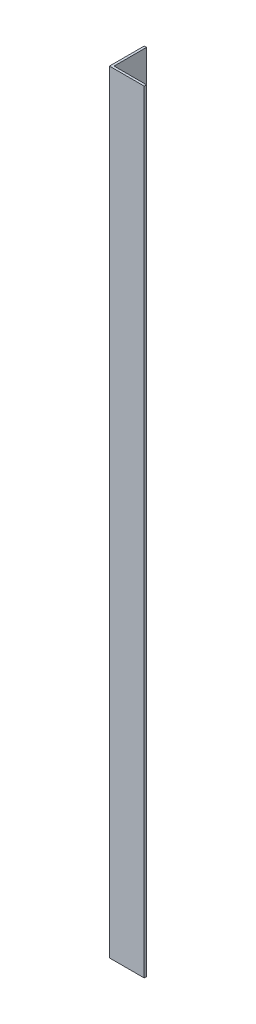
ISO-10303-21;
HEADER;
FILE_DESCRIPTION(('STEP AP214'),'2;1');
FILE_NAME('part.step','',(''),(''),'','','');
FILE_SCHEMA(('AUTOMOTIVE_DESIGN { 1 0 10303 214 1 1 1 1 }'));
ENDSEC;
DATA;
#1=APPLICATION_CONTEXT('core data for automotive mechanical design processes');
#2=APPLICATION_PROTOCOL_DEFINITION('international standard','automotive_design',2000,#1);
#3=PRODUCT_CONTEXT('',#1,'mechanical');
#4=PRODUCT('Part','Part','',(#3));
#5=PRODUCT_RELATED_PRODUCT_CATEGORY('part','',(#4));
#6=PRODUCT_DEFINITION_FORMATION('','',#4);
#7=PRODUCT_DEFINITION_CONTEXT('part definition',#1,'design');
#8=PRODUCT_DEFINITION('design','',#6,#7);
#9=PRODUCT_DEFINITION_SHAPE('','',#8);
#10=(LENGTH_UNIT() NAMED_UNIT(*) SI_UNIT(.MILLI.,.METRE.));
#11=(NAMED_UNIT(*) PLANE_ANGLE_UNIT() SI_UNIT($,.RADIAN.));
#12=(NAMED_UNIT(*) SI_UNIT($,.STERADIAN.) SOLID_ANGLE_UNIT());
#13=UNCERTAINTY_MEASURE_WITH_UNIT(LENGTH_MEASURE(1.E-05),#10,'distance_accuracy_value','');
#14=(GEOMETRIC_REPRESENTATION_CONTEXT(3) GLOBAL_UNCERTAINTY_ASSIGNED_CONTEXT((#13)) GLOBAL_UNIT_ASSIGNED_CONTEXT((#10,
#11,#12)) REPRESENTATION_CONTEXT('',''));
#15=CARTESIAN_POINT('',(0.,0.,0.));
#16=DIRECTION('',(0.,0.,1.));
#17=DIRECTION('',(1.,0.,0.));
#18=AXIS2_PLACEMENT_3D('',#15,#16,#17);
#19=CARTESIAN_POINT('',(0.,1000.,0.));
#20=DIRECTION('',(0.,0.,-1.));
#21=DIRECTION('',(-1.,0.,0.));
#22=AXIS2_PLACEMENT_3D('',#19,#20,#21);
#23=PLANE('',#22);
#24=DIRECTION('',(1.,0.,0.));
#25=VECTOR('',#24,1.);
#26=CARTESIAN_POINT('',(0.,0.,0.));
#27=LINE('',#26,#25);
#28=CARTESIAN_POINT('',(0.,0.,0.));
#29=VERTEX_POINT('',#28);
#30=CARTESIAN_POINT('',(45.,0.,0.));
#31=VERTEX_POINT('',#30);
#32=EDGE_CURVE('E115',#29,#31,#27,.T.);
#33=ORIENTED_EDGE('',*,*,#32,.T.);
#34=DIRECTION('',(0.,-1.,0.));
#35=VECTOR('',#34,1.);
#36=CARTESIAN_POINT('',(45.,1000.,0.));
#37=LINE('',#36,#35);
#38=CARTESIAN_POINT('',(45.,1000.,0.));
#39=VERTEX_POINT('',#38);
#40=EDGE_CURVE('E11',#39,#31,#37,.T.);
#41=ORIENTED_EDGE('',*,*,#40,.F.);
#42=DIRECTION('',(1.,0.,0.));
#43=VECTOR('',#42,1.);
#44=CARTESIAN_POINT('',(0.,1000.,0.));
#45=LINE('',#44,#43);
#46=CARTESIAN_POINT('',(0.,1000.,0.));
#47=VERTEX_POINT('',#46);
#48=EDGE_CURVE('E80',#47,#39,#45,.T.);
#49=ORIENTED_EDGE('',*,*,#48,.F.);
#50=DIRECTION('',(0.,-1.,0.));
#51=VECTOR('',#50,1.);
#52=CARTESIAN_POINT('',(0.,1000.,0.));
#53=LINE('',#52,#51);
#54=EDGE_CURVE('E111',#47,#29,#53,.T.);
#55=ORIENTED_EDGE('',*,*,#54,.T.);
#56=EDGE_LOOP('',(#33,#41,#49,#55));
#57=FACE_BOUND('',#56,.T.);
#58=ADVANCED_FACE('F34',(#57),#23,.F.);
#59=CARTESIAN_POINT('',(45.,1000.,-3.));
#60=DIRECTION('',(1.,0.,0.));
#61=DIRECTION('',(0.,0.,-1.));
#62=AXIS2_PLACEMENT_3D('',#59,#60,#61);
#63=PLANE('',#62);
#64=DIRECTION('',(0.,0.,1.));
#65=VECTOR('',#64,1.);
#66=CARTESIAN_POINT('',(45.,0.,-3.));
#67=LINE('',#66,#65);
#68=CARTESIAN_POINT('',(45.,0.,-3.));
#69=VERTEX_POINT('',#68);
#70=EDGE_CURVE('E118',#69,#31,#67,.T.);
#71=ORIENTED_EDGE('',*,*,#70,.F.);
#72=DIRECTION('',(0.,-1.,0.));
#73=VECTOR('',#72,1.);
#74=CARTESIAN_POINT('',(45.,1000.,-3.));
#75=LINE('',#74,#73);
#76=CARTESIAN_POINT('',(45.,1000.,-3.));
#77=VERTEX_POINT('',#76);
#78=EDGE_CURVE('E42',#77,#69,#75,.T.);
#79=ORIENTED_EDGE('',*,*,#78,.F.);
#80=DIRECTION('',(0.,0.,1.));
#81=VECTOR('',#80,1.);
#82=CARTESIAN_POINT('',(45.,1000.,-3.));
#83=LINE('',#82,#81);
#84=EDGE_CURVE('E204',#77,#39,#83,.T.);
#85=ORIENTED_EDGE('',*,*,#84,.T.);
#86=ORIENTED_EDGE('',*,*,#40,.T.);
#87=EDGE_LOOP('',(#71,#79,#85,#86));
#88=FACE_BOUND('',#87,.T.);
#89=ADVANCED_FACE('F136',(#88),#63,.T.);
#90=CARTESIAN_POINT('',(0.,1000.,-3.));
#91=DIRECTION('',(0.,0.,-1.));
#92=DIRECTION('',(-1.,0.,0.));
#93=AXIS2_PLACEMENT_3D('',#90,#91,#92);
#94=PLANE('',#93);
#95=DIRECTION('',(1.,0.,0.));
#96=VECTOR('',#95,1.);
#97=CARTESIAN_POINT('',(0.,0.,-3.));
#98=LINE('',#97,#96);
#99=CARTESIAN_POINT('',(3.,0.,-3.));
#100=VERTEX_POINT('',#99);
#101=EDGE_CURVE('E121',#100,#69,#98,.T.);
#102=ORIENTED_EDGE('',*,*,#101,.F.);
#103=DIRECTION('',(0.,-1.,0.));
#104=VECTOR('',#103,1.);
#105=CARTESIAN_POINT('',(3.,1000.,-3.));
#106=LINE('',#105,#104);
#107=CARTESIAN_POINT('',(3.,1000.,-3.));
#108=VERTEX_POINT('',#107);
#109=EDGE_CURVE('E101',#108,#100,#106,.T.);
#110=ORIENTED_EDGE('',*,*,#109,.F.);
#111=DIRECTION('',(1.,0.,0.));
#112=VECTOR('',#111,1.);
#113=CARTESIAN_POINT('',(0.,1000.,-3.));
#114=LINE('',#113,#112);
#115=EDGE_CURVE('E107',#108,#77,#114,.T.);
#116=ORIENTED_EDGE('',*,*,#115,.T.);
#117=ORIENTED_EDGE('',*,*,#78,.T.);
#118=EDGE_LOOP('',(#102,#110,#116,#117));
#119=FACE_BOUND('',#118,.T.);
#120=ADVANCED_FACE('F133',(#119),#94,.T.);
#121=CARTESIAN_POINT('',(3.,1000.,-45.));
#122=DIRECTION('',(1.,0.,0.));
#123=DIRECTION('',(0.,0.,-1.));
#124=AXIS2_PLACEMENT_3D('',#121,#122,#123);
#125=PLANE('',#124);
#126=DIRECTION('',(0.,0.,1.));
#127=VECTOR('',#126,1.);
#128=CARTESIAN_POINT('',(3.,0.,-45.));
#129=LINE('',#128,#127);
#130=CARTESIAN_POINT('',(3.,0.,-45.));
#131=VERTEX_POINT('',#130);
#132=EDGE_CURVE('E96',#131,#100,#129,.T.);
#133=ORIENTED_EDGE('',*,*,#132,.F.);
#134=DIRECTION('',(0.,-1.,0.));
#135=VECTOR('',#134,1.);
#136=CARTESIAN_POINT('',(3.,1000.,-45.));
#137=LINE('',#136,#135);
#138=CARTESIAN_POINT('',(3.,1000.,-45.));
#139=VERTEX_POINT('',#138);
#140=EDGE_CURVE('E91',#139,#131,#137,.T.);
#141=ORIENTED_EDGE('',*,*,#140,.F.);
#142=DIRECTION('',(0.,0.,1.));
#143=VECTOR('',#142,1.);
#144=CARTESIAN_POINT('',(3.,1000.,-45.));
#145=LINE('',#144,#143);
#146=EDGE_CURVE('E94',#139,#108,#145,.T.);
#147=ORIENTED_EDGE('',*,*,#146,.T.);
#148=ORIENTED_EDGE('',*,*,#109,.T.);
#149=EDGE_LOOP('',(#133,#141,#147,#148));
#150=FACE_BOUND('',#149,.T.);
#151=ADVANCED_FACE('F93',(#150),#125,.T.);
#152=CARTESIAN_POINT('',(0.,1000.,-45.));
#153=DIRECTION('',(0.,0.,-1.));
#154=DIRECTION('',(-1.,0.,0.));
#155=AXIS2_PLACEMENT_3D('',#152,#153,#154);
#156=PLANE('',#155);
#157=DIRECTION('',(1.,0.,0.));
#158=VECTOR('',#157,1.);
#159=CARTESIAN_POINT('',(0.,0.,-45.));
#160=LINE('',#159,#158);
#161=CARTESIAN_POINT('',(0.,0.,-45.));
#162=VERTEX_POINT('',#161);
#163=EDGE_CURVE('E125',#162,#131,#160,.T.);
#164=ORIENTED_EDGE('',*,*,#163,.F.);
#165=DIRECTION('',(0.,-1.,0.));
#166=VECTOR('',#165,1.);
#167=CARTESIAN_POINT('',(0.,1000.,-45.));
#168=LINE('',#167,#166);
#169=CARTESIAN_POINT('',(0.,1000.,-45.));
#170=VERTEX_POINT('',#169);
#171=EDGE_CURVE('E71',#170,#162,#168,.T.);
#172=ORIENTED_EDGE('',*,*,#171,.F.);
#173=DIRECTION('',(1.,0.,0.));
#174=VECTOR('',#173,1.);
#175=CARTESIAN_POINT('',(0.,1000.,-45.));
#176=LINE('',#175,#174);
#177=EDGE_CURVE('E105',#170,#139,#176,.T.);
#178=ORIENTED_EDGE('',*,*,#177,.T.);
#179=ORIENTED_EDGE('',*,*,#140,.T.);
#180=EDGE_LOOP('',(#164,#172,#178,#179));
#181=FACE_BOUND('',#180,.T.);
#182=ADVANCED_FACE('F109',(#181),#156,.T.);
#183=CARTESIAN_POINT('',(0.,1000.,-45.));
#184=DIRECTION('',(1.,0.,0.));
#185=DIRECTION('',(0.,0.,-1.));
#186=AXIS2_PLACEMENT_3D('',#183,#184,#185);
#187=PLANE('',#186);
#188=DIRECTION('',(0.,0.,1.));
#189=VECTOR('',#188,1.);
#190=CARTESIAN_POINT('',(0.,0.,-45.));
#191=LINE('',#190,#189);
#192=EDGE_CURVE('E74',#162,#29,#191,.T.);
#193=ORIENTED_EDGE('',*,*,#192,.T.);
#194=ORIENTED_EDGE('',*,*,#54,.F.);
#195=DIRECTION('',(0.,0.,1.));
#196=VECTOR('',#195,1.);
#197=CARTESIAN_POINT('',(0.,1000.,-45.));
#198=LINE('',#197,#196);
#199=EDGE_CURVE('E50',#170,#47,#198,.T.);
#200=ORIENTED_EDGE('',*,*,#199,.F.);
#201=ORIENTED_EDGE('',*,*,#171,.T.);
#202=EDGE_LOOP('',(#193,#194,#200,#201));
#203=FACE_BOUND('',#202,.T.);
#204=ADVANCED_FACE('F141',(#203),#187,.F.);
#205=CARTESIAN_POINT('',(0.,1000.,0.));
#206=DIRECTION('',(0.,-1.,0.));
#207=DIRECTION('',(-1.,0.,0.));
#208=AXIS2_PLACEMENT_3D('',#205,#206,#207);
#209=PLANE('',#208);
#210=ORIENTED_EDGE('',*,*,#48,.T.);
#211=ORIENTED_EDGE('',*,*,#84,.F.);
#212=ORIENTED_EDGE('',*,*,#115,.F.);
#213=ORIENTED_EDGE('',*,*,#146,.F.);
#214=ORIENTED_EDGE('',*,*,#177,.F.);
#215=ORIENTED_EDGE('',*,*,#199,.T.);
#216=EDGE_LOOP('',(#210,#211,#212,#213,#214,#215));
#217=FACE_BOUND('',#216,.T.);
#218=ADVANCED_FACE('F104',(#217),#209,.F.);
#219=CARTESIAN_POINT('',(0.,0.,0.));
#220=DIRECTION('',(0.,-1.,0.));
#221=DIRECTION('',(-1.,0.,0.));
#222=AXIS2_PLACEMENT_3D('',#219,#220,#221);
#223=PLANE('',#222);
#224=ORIENTED_EDGE('',*,*,#32,.F.);
#225=ORIENTED_EDGE('',*,*,#192,.F.);
#226=ORIENTED_EDGE('',*,*,#163,.T.);
#227=ORIENTED_EDGE('',*,*,#132,.T.);
#228=ORIENTED_EDGE('',*,*,#101,.T.);
#229=ORIENTED_EDGE('',*,*,#70,.T.);
#230=EDGE_LOOP('',(#224,#225,#226,#227,#228,#229));
#231=FACE_BOUND('',#230,.T.);
#232=ADVANCED_FACE('F139',(#231),#223,.T.);
#233=CLOSED_SHELL('',(#58,#89,#120,#151,#182,#204,#218,#232));
#234=MANIFOLD_SOLID_BREP('B2',#233);
#235=ADVANCED_BREP_SHAPE_REPRESENTATION('',(#18,#234),#14);
#236=SHAPE_DEFINITION_REPRESENTATION(#9,#235);
ENDSEC;
END-ISO-10303-21;
